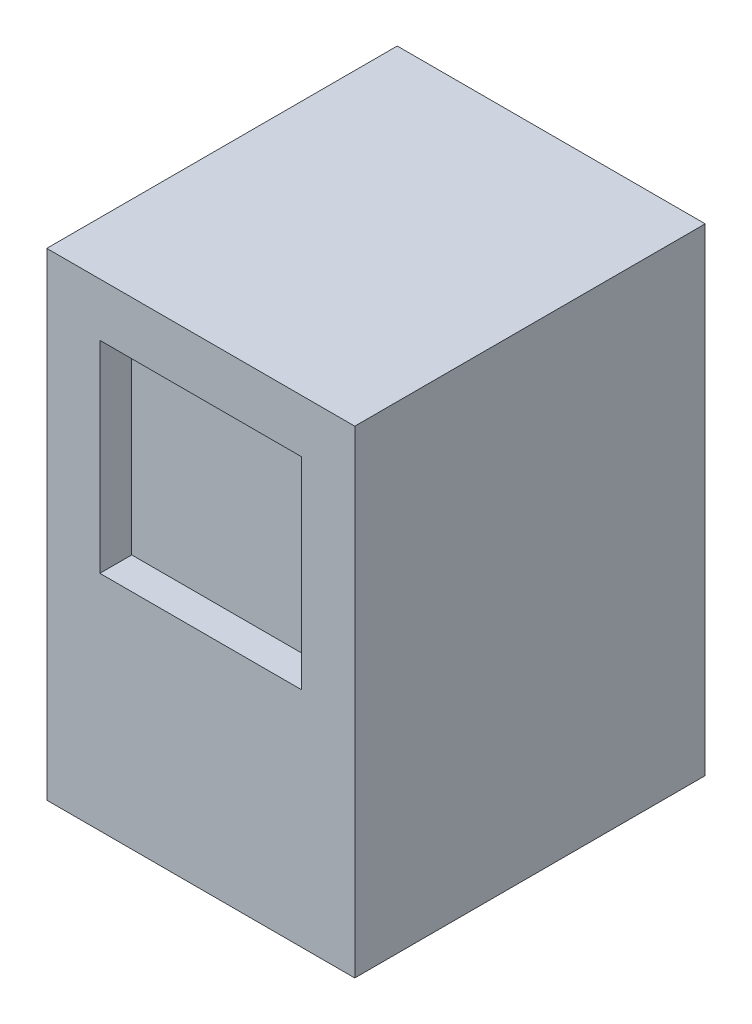
ISO-10303-21;
HEADER;
FILE_DESCRIPTION(('STEP AP214'),'2;1');
FILE_NAME('part.step','',(''),(''),'','','');
FILE_SCHEMA(('AUTOMOTIVE_DESIGN { 1 0 10303 214 1 1 1 1 }'));
ENDSEC;
DATA;
#1=APPLICATION_CONTEXT('core data for automotive mechanical design processes');
#2=APPLICATION_PROTOCOL_DEFINITION('international standard','automotive_design',2000,#1);
#3=PRODUCT_CONTEXT('',#1,'mechanical');
#4=PRODUCT('Part','Part','',(#3));
#5=PRODUCT_RELATED_PRODUCT_CATEGORY('part','',(#4));
#6=PRODUCT_DEFINITION_FORMATION('','',#4);
#7=PRODUCT_DEFINITION_CONTEXT('part definition',#1,'design');
#8=PRODUCT_DEFINITION('design','',#6,#7);
#9=PRODUCT_DEFINITION_SHAPE('','',#8);
#10=(LENGTH_UNIT() NAMED_UNIT(*) SI_UNIT(.MILLI.,.METRE.));
#11=(NAMED_UNIT(*) PLANE_ANGLE_UNIT() SI_UNIT($,.RADIAN.));
#12=(NAMED_UNIT(*) SI_UNIT($,.STERADIAN.) SOLID_ANGLE_UNIT());
#13=UNCERTAINTY_MEASURE_WITH_UNIT(LENGTH_MEASURE(1.E-05),#10,'distance_accuracy_value','');
#14=(GEOMETRIC_REPRESENTATION_CONTEXT(3) GLOBAL_UNCERTAINTY_ASSIGNED_CONTEXT((#13)) GLOBAL_UNIT_ASSIGNED_CONTEXT((#10,
#11,#12)) REPRESENTATION_CONTEXT('',''));
#15=CARTESIAN_POINT('',(0.,0.,0.));
#16=DIRECTION('',(0.,0.,1.));
#17=DIRECTION('',(1.,0.,0.));
#18=AXIS2_PLACEMENT_3D('',#15,#16,#17);
#19=CARTESIAN_POINT('',(368.3,1143.,419.1));
#20=DIRECTION('',(-1.,0.,0.));
#21=DIRECTION('',(0.,0.,1.));
#22=AXIS2_PLACEMENT_3D('',#19,#20,#21);
#23=PLANE('',#22);
#24=DIRECTION('',(0.,0.,-1.));
#25=VECTOR('',#24,1.);
#26=CARTESIAN_POINT('',(368.3,0.,419.1));
#27=LINE('',#26,#25);
#28=CARTESIAN_POINT('',(368.3,0.,419.1));
#29=VERTEX_POINT('',#28);
#30=CARTESIAN_POINT('',(368.3,0.,-419.1));
#31=VERTEX_POINT('',#30);
#32=EDGE_CURVE('E141',#29,#31,#27,.T.);
#33=ORIENTED_EDGE('',*,*,#32,.T.);
#34=DIRECTION('',(0.,-1.,0.));
#35=VECTOR('',#34,1.);
#36=CARTESIAN_POINT('',(368.3,1143.,-419.1));
#37=LINE('',#36,#35);
#38=CARTESIAN_POINT('',(368.3,1143.,-419.1));
#39=VERTEX_POINT('',#38);
#40=EDGE_CURVE('E11',#39,#31,#37,.T.);
#41=ORIENTED_EDGE('',*,*,#40,.F.);
#42=DIRECTION('',(0.,0.,-1.));
#43=VECTOR('',#42,1.);
#44=CARTESIAN_POINT('',(368.3,1143.,419.1));
#45=LINE('',#44,#43);
#46=CARTESIAN_POINT('',(368.3,1143.,419.1));
#47=VERTEX_POINT('',#46);
#48=EDGE_CURVE('E145',#47,#39,#45,.T.);
#49=ORIENTED_EDGE('',*,*,#48,.F.);
#50=DIRECTION('',(0.,-1.,0.));
#51=VECTOR('',#50,1.);
#52=CARTESIAN_POINT('',(368.3,1143.,419.1));
#53=LINE('',#52,#51);
#54=EDGE_CURVE('E151',#47,#29,#53,.T.);
#55=ORIENTED_EDGE('',*,*,#54,.T.);
#56=EDGE_LOOP('',(#33,#41,#49,#55));
#57=FACE_BOUND('',#56,.T.);
#58=ADVANCED_FACE('F33',(#57),#23,.F.);
#59=CARTESIAN_POINT('',(-368.3,1143.,-419.1));
#60=DIRECTION('',(0.,0.,1.));
#61=DIRECTION('',(1.,0.,0.));
#62=AXIS2_PLACEMENT_3D('',#59,#60,#61);
#63=PLANE('',#62);
#64=DIRECTION('',(-1.,0.,0.));
#65=VECTOR('',#64,1.);
#66=CARTESIAN_POINT('',(-368.3,0.,-419.1));
#67=LINE('',#66,#65);
#68=CARTESIAN_POINT('',(-368.3,0.,-419.1));
#69=VERTEX_POINT('',#68);
#70=EDGE_CURVE('E154',#31,#69,#67,.T.);
#71=ORIENTED_EDGE('',*,*,#70,.T.);
#72=DIRECTION('',(0.,-1.,0.));
#73=VECTOR('',#72,1.);
#74=CARTESIAN_POINT('',(-368.3,1143.,-419.1));
#75=LINE('',#74,#73);
#76=CARTESIAN_POINT('',(-368.3,1143.,-419.1));
#77=VERTEX_POINT('',#76);
#78=EDGE_CURVE('E40',#77,#69,#75,.T.);
#79=ORIENTED_EDGE('',*,*,#78,.F.);
#80=DIRECTION('',(-1.,0.,0.));
#81=VECTOR('',#80,1.);
#82=CARTESIAN_POINT('',(-368.3,1143.,-419.1));
#83=LINE('',#82,#81);
#84=EDGE_CURVE('E84',#39,#77,#83,.T.);
#85=ORIENTED_EDGE('',*,*,#84,.F.);
#86=ORIENTED_EDGE('',*,*,#40,.T.);
#87=EDGE_LOOP('',(#71,#79,#85,#86));
#88=FACE_BOUND('',#87,.T.);
#89=ADVANCED_FACE('F183',(#88),#63,.F.);
#90=CARTESIAN_POINT('',(-368.3,1143.,419.1));
#91=DIRECTION('',(1.,0.,0.));
#92=DIRECTION('',(0.,0.,-1.));
#93=AXIS2_PLACEMENT_3D('',#90,#91,#92);
#94=PLANE('',#93);
#95=DIRECTION('',(0.,0.,1.));
#96=VECTOR('',#95,1.);
#97=CARTESIAN_POINT('',(-368.3,0.,419.1));
#98=LINE('',#97,#96);
#99=CARTESIAN_POINT('',(-368.3,0.,419.1));
#100=VERTEX_POINT('',#99);
#101=EDGE_CURVE('E156',#69,#100,#98,.T.);
#102=ORIENTED_EDGE('',*,*,#101,.T.);
#103=DIRECTION('',(0.,-1.,0.));
#104=VECTOR('',#103,1.);
#105=CARTESIAN_POINT('',(-368.3,1143.,419.1));
#106=LINE('',#105,#104);
#107=CARTESIAN_POINT('',(-368.3,1143.,419.1));
#108=VERTEX_POINT('',#107);
#109=EDGE_CURVE('E160',#108,#100,#106,.T.);
#110=ORIENTED_EDGE('',*,*,#109,.F.);
#111=DIRECTION('',(0.,0.,1.));
#112=VECTOR('',#111,1.);
#113=CARTESIAN_POINT('',(-368.3,1143.,419.1));
#114=LINE('',#113,#112);
#115=EDGE_CURVE('E148',#77,#108,#114,.T.);
#116=ORIENTED_EDGE('',*,*,#115,.F.);
#117=ORIENTED_EDGE('',*,*,#78,.T.);
#118=EDGE_LOOP('',(#102,#110,#116,#117));
#119=FACE_BOUND('',#118,.T.);
#120=ADVANCED_FACE('F165',(#119),#94,.F.);
#121=CARTESIAN_POINT('',(-368.3,1143.,419.1));
#122=DIRECTION('',(0.,0.,-1.));
#123=DIRECTION('',(-1.,0.,0.));
#124=AXIS2_PLACEMENT_3D('',#121,#122,#123);
#125=PLANE('',#124);
#126=DIRECTION('',(-1.,0.,0.));
#127=VECTOR('',#126,1.);
#128=CARTESIAN_POINT('',(-241.3,1016.,419.1));
#129=LINE('',#128,#127);
#130=CARTESIAN_POINT('',(241.3,1016.,419.1));
#131=VERTEX_POINT('',#130);
#132=CARTESIAN_POINT('',(-241.3,1016.,419.1));
#133=VERTEX_POINT('',#132);
#134=EDGE_CURVE('E135',#131,#133,#129,.T.);
#135=ORIENTED_EDGE('',*,*,#134,.F.);
#136=DIRECTION('',(0.,1.,0.));
#137=VECTOR('',#136,1.);
#138=CARTESIAN_POINT('',(241.3,533.4,419.1));
#139=LINE('',#138,#137);
#140=CARTESIAN_POINT('',(241.3,533.4,419.1));
#141=VERTEX_POINT('',#140);
#142=EDGE_CURVE('E47',#141,#131,#139,.T.);
#143=ORIENTED_EDGE('',*,*,#142,.F.);
#144=DIRECTION('',(1.,0.,0.));
#145=VECTOR('',#144,1.);
#146=CARTESIAN_POINT('',(-241.3,533.4,419.1));
#147=LINE('',#146,#145);
#148=CARTESIAN_POINT('',(-241.3,533.4,419.1));
#149=VERTEX_POINT('',#148);
#150=EDGE_CURVE('E126',#149,#141,#147,.T.);
#151=ORIENTED_EDGE('',*,*,#150,.F.);
#152=DIRECTION('',(0.,-1.,0.));
#153=VECTOR('',#152,1.);
#154=CARTESIAN_POINT('',(-241.3,533.4,419.1));
#155=LINE('',#154,#153);
#156=EDGE_CURVE('E129',#133,#149,#155,.T.);
#157=ORIENTED_EDGE('',*,*,#156,.F.);
#158=EDGE_LOOP('',(#135,#143,#151,#157));
#159=FACE_BOUND('',#158,.T.);
#160=DIRECTION('',(1.,0.,0.));
#161=VECTOR('',#160,1.);
#162=CARTESIAN_POINT('',(-368.3,0.,419.1));
#163=LINE('',#162,#161);
#164=EDGE_CURVE('E77',#100,#29,#163,.T.);
#165=ORIENTED_EDGE('',*,*,#164,.T.);
#166=ORIENTED_EDGE('',*,*,#54,.F.);
#167=DIRECTION('',(1.,0.,0.));
#168=VECTOR('',#167,1.);
#169=CARTESIAN_POINT('',(-368.3,1143.,419.1));
#170=LINE('',#169,#168);
#171=EDGE_CURVE('E56',#108,#47,#170,.T.);
#172=ORIENTED_EDGE('',*,*,#171,.F.);
#173=ORIENTED_EDGE('',*,*,#109,.T.);
#174=EDGE_LOOP('',(#165,#166,#172,#173));
#175=FACE_BOUND('',#174,.T.);
#176=ADVANCED_FACE('F173',(#159,#175),#125,.F.);
#177=CARTESIAN_POINT('',(0.,1143.,0.));
#178=DIRECTION('',(0.,-1.,0.));
#179=DIRECTION('',(0.,0.,-1.));
#180=AXIS2_PLACEMENT_3D('',#177,#178,#179);
#181=PLANE('',#180);
#182=ORIENTED_EDGE('',*,*,#48,.T.);
#183=ORIENTED_EDGE('',*,*,#84,.T.);
#184=ORIENTED_EDGE('',*,*,#115,.T.);
#185=ORIENTED_EDGE('',*,*,#171,.T.);
#186=EDGE_LOOP('',(#182,#183,#184,#185));
#187=FACE_BOUND('',#186,.T.);
#188=ADVANCED_FACE('F175',(#187),#181,.F.);
#189=CARTESIAN_POINT('',(0.,0.,0.));
#190=DIRECTION('',(0.,-1.,0.));
#191=DIRECTION('',(0.,0.,-1.));
#192=AXIS2_PLACEMENT_3D('',#189,#190,#191);
#193=PLANE('',#192);
#194=ORIENTED_EDGE('',*,*,#32,.F.);
#195=ORIENTED_EDGE('',*,*,#164,.F.);
#196=ORIENTED_EDGE('',*,*,#101,.F.);
#197=ORIENTED_EDGE('',*,*,#70,.F.);
#198=EDGE_LOOP('',(#194,#195,#196,#197));
#199=FACE_BOUND('',#198,.T.);
#200=ADVANCED_FACE('F169',(#199),#193,.T.);
#201=CARTESIAN_POINT('',(241.3,533.4,342.9));
#202=DIRECTION('',(1.,0.,0.));
#203=DIRECTION('',(0.,0.,-1.));
#204=AXIS2_PLACEMENT_3D('',#201,#202,#203);
#205=PLANE('',#204);
#206=ORIENTED_EDGE('',*,*,#142,.T.);
#207=DIRECTION('',(0.,0.,1.));
#208=VECTOR('',#207,1.);
#209=CARTESIAN_POINT('',(241.3,1016.,342.9));
#210=LINE('',#209,#208);
#211=CARTESIAN_POINT('',(241.3,1016.,342.9));
#212=VERTEX_POINT('',#211);
#213=EDGE_CURVE('E104',#212,#131,#210,.T.);
#214=ORIENTED_EDGE('',*,*,#213,.F.);
#215=DIRECTION('',(0.,1.,0.));
#216=VECTOR('',#215,1.);
#217=CARTESIAN_POINT('',(241.3,533.4,342.9));
#218=LINE('',#217,#216);
#219=CARTESIAN_POINT('',(241.3,533.4,342.9));
#220=VERTEX_POINT('',#219);
#221=EDGE_CURVE('E108',#220,#212,#218,.T.);
#222=ORIENTED_EDGE('',*,*,#221,.F.);
#223=DIRECTION('',(0.,0.,1.));
#224=VECTOR('',#223,1.);
#225=CARTESIAN_POINT('',(241.3,533.4,342.9));
#226=LINE('',#225,#224);
#227=EDGE_CURVE('E139',#220,#141,#226,.T.);
#228=ORIENTED_EDGE('',*,*,#227,.T.);
#229=EDGE_LOOP('',(#206,#214,#222,#228));
#230=FACE_BOUND('',#229,.T.);
#231=ADVANCED_FACE('F106',(#230),#205,.F.);
#232=CARTESIAN_POINT('',(-241.3,533.4,342.9));
#233=DIRECTION('',(0.,-1.,0.));
#234=DIRECTION('',(0.,0.,-1.));
#235=AXIS2_PLACEMENT_3D('',#232,#233,#234);
#236=PLANE('',#235);
#237=ORIENTED_EDGE('',*,*,#150,.T.);
#238=ORIENTED_EDGE('',*,*,#227,.F.);
#239=DIRECTION('',(1.,0.,0.));
#240=VECTOR('',#239,1.);
#241=CARTESIAN_POINT('',(-241.3,533.4,342.9));
#242=LINE('',#241,#240);
#243=CARTESIAN_POINT('',(-241.3,533.4,342.9));
#244=VERTEX_POINT('',#243);
#245=EDGE_CURVE('E114',#244,#220,#242,.T.);
#246=ORIENTED_EDGE('',*,*,#245,.F.);
#247=DIRECTION('',(0.,0.,1.));
#248=VECTOR('',#247,1.);
#249=CARTESIAN_POINT('',(-241.3,533.4,342.9));
#250=LINE('',#249,#248);
#251=EDGE_CURVE('E142',#244,#149,#250,.T.);
#252=ORIENTED_EDGE('',*,*,#251,.T.);
#253=EDGE_LOOP('',(#237,#238,#246,#252));
#254=FACE_BOUND('',#253,.T.);
#255=ADVANCED_FACE('F222',(#254),#236,.F.);
#256=CARTESIAN_POINT('',(-241.3,533.4,342.9));
#257=DIRECTION('',(-1.,0.,0.));
#258=DIRECTION('',(0.,0.,1.));
#259=AXIS2_PLACEMENT_3D('',#256,#257,#258);
#260=PLANE('',#259);
#261=ORIENTED_EDGE('',*,*,#156,.T.);
#262=ORIENTED_EDGE('',*,*,#251,.F.);
#263=DIRECTION('',(0.,-1.,0.));
#264=VECTOR('',#263,1.);
#265=CARTESIAN_POINT('',(-241.3,533.4,342.9));
#266=LINE('',#265,#264);
#267=CARTESIAN_POINT('',(-241.3,1016.,342.9));
#268=VERTEX_POINT('',#267);
#269=EDGE_CURVE('E122',#268,#244,#266,.T.);
#270=ORIENTED_EDGE('',*,*,#269,.F.);
#271=DIRECTION('',(0.,0.,1.));
#272=VECTOR('',#271,1.);
#273=CARTESIAN_POINT('',(-241.3,1016.,342.9));
#274=LINE('',#273,#272);
#275=EDGE_CURVE('E113',#268,#133,#274,.T.);
#276=ORIENTED_EDGE('',*,*,#275,.T.);
#277=EDGE_LOOP('',(#261,#262,#270,#276));
#278=FACE_BOUND('',#277,.T.);
#279=ADVANCED_FACE('F231',(#278),#260,.F.);
#280=CARTESIAN_POINT('',(-241.3,1016.,342.9));
#281=DIRECTION('',(0.,1.,0.));
#282=DIRECTION('',(0.,0.,1.));
#283=AXIS2_PLACEMENT_3D('',#280,#281,#282);
#284=PLANE('',#283);
#285=ORIENTED_EDGE('',*,*,#134,.T.);
#286=ORIENTED_EDGE('',*,*,#275,.F.);
#287=DIRECTION('',(-1.,0.,0.));
#288=VECTOR('',#287,1.);
#289=CARTESIAN_POINT('',(-241.3,1016.,342.9));
#290=LINE('',#289,#288);
#291=EDGE_CURVE('E117',#212,#268,#290,.T.);
#292=ORIENTED_EDGE('',*,*,#291,.F.);
#293=ORIENTED_EDGE('',*,*,#213,.T.);
#294=EDGE_LOOP('',(#285,#286,#292,#293));
#295=FACE_BOUND('',#294,.T.);
#296=ADVANCED_FACE('F118',(#295),#284,.F.);
#297=CARTESIAN_POINT('',(0.,0.,342.9));
#298=DIRECTION('',(0.,0.,-1.));
#299=DIRECTION('',(-1.,0.,0.));
#300=AXIS2_PLACEMENT_3D('',#297,#298,#299);
#301=PLANE('',#300);
#302=ORIENTED_EDGE('',*,*,#221,.T.);
#303=ORIENTED_EDGE('',*,*,#291,.T.);
#304=ORIENTED_EDGE('',*,*,#269,.T.);
#305=ORIENTED_EDGE('',*,*,#245,.T.);
#306=EDGE_LOOP('',(#302,#303,#304,#305));
#307=FACE_BOUND('',#306,.T.);
#308=ADVANCED_FACE('F124',(#307),#301,.F.);
#309=CLOSED_SHELL('',(#58,#89,#120,#176,#188,#200,#231,#255,#279,#296,#308));
#310=MANIFOLD_SOLID_BREP('B2',#309);
#311=ADVANCED_BREP_SHAPE_REPRESENTATION('',(#18,#310),#14);
#312=SHAPE_DEFINITION_REPRESENTATION(#9,#311);
ENDSEC;
END-ISO-10303-21;
